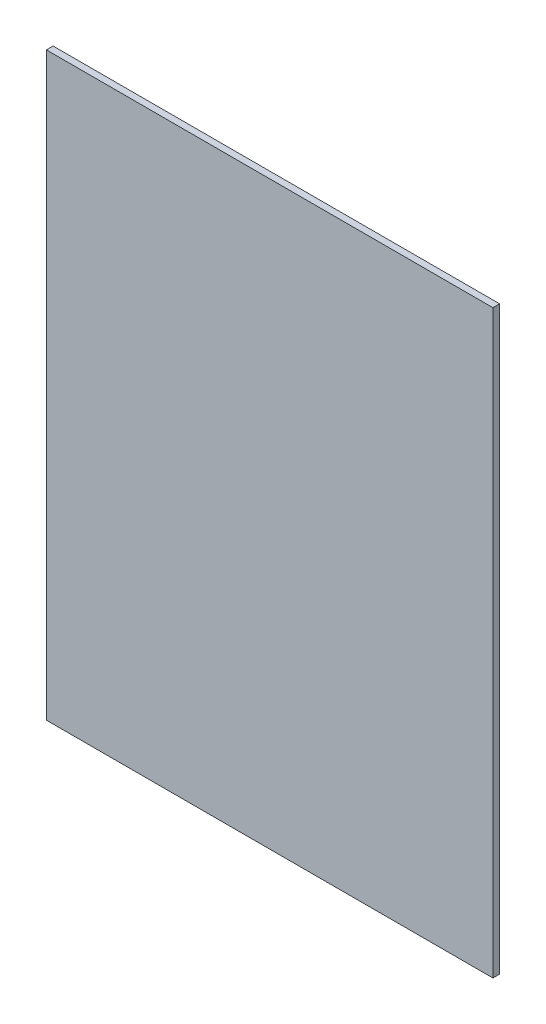
ISO-10303-21;
HEADER;
FILE_DESCRIPTION(('STEP AP214'),'2;1');
FILE_NAME('part.step','',(''),(''),'','','');
FILE_SCHEMA(('AUTOMOTIVE_DESIGN { 1 0 10303 214 1 1 1 1 }'));
ENDSEC;
DATA;
#1=APPLICATION_CONTEXT('core data for automotive mechanical design processes');
#2=APPLICATION_PROTOCOL_DEFINITION('international standard','automotive_design',2000,#1);
#3=PRODUCT_CONTEXT('',#1,'mechanical');
#4=PRODUCT('Part','Part','',(#3));
#5=PRODUCT_RELATED_PRODUCT_CATEGORY('part','',(#4));
#6=PRODUCT_DEFINITION_FORMATION('','',#4);
#7=PRODUCT_DEFINITION_CONTEXT('part definition',#1,'design');
#8=PRODUCT_DEFINITION('design','',#6,#7);
#9=PRODUCT_DEFINITION_SHAPE('','',#8);
#10=(LENGTH_UNIT() NAMED_UNIT(*) SI_UNIT(.MILLI.,.METRE.));
#11=(NAMED_UNIT(*) PLANE_ANGLE_UNIT() SI_UNIT($,.RADIAN.));
#12=(NAMED_UNIT(*) SI_UNIT($,.STERADIAN.) SOLID_ANGLE_UNIT());
#13=UNCERTAINTY_MEASURE_WITH_UNIT(LENGTH_MEASURE(1.E-05),#10,'distance_accuracy_value','');
#14=(GEOMETRIC_REPRESENTATION_CONTEXT(3) GLOBAL_UNCERTAINTY_ASSIGNED_CONTEXT((#13)) GLOBAL_UNIT_ASSIGNED_CONTEXT((#10,
#11,#12)) REPRESENTATION_CONTEXT('',''));
#15=CARTESIAN_POINT('',(0.,0.,0.));
#16=DIRECTION('',(0.,0.,1.));
#17=DIRECTION('',(1.,0.,0.));
#18=AXIS2_PLACEMENT_3D('',#15,#16,#17);
#19=CARTESIAN_POINT('',(100.,130.,3.));
#20=DIRECTION('',(-1.,0.,0.));
#21=DIRECTION('',(0.,-1.,0.));
#22=AXIS2_PLACEMENT_3D('',#19,#20,#21);
#23=PLANE('',#22);
#24=DIRECTION('',(0.,1.,0.));
#25=VECTOR('',#24,1.);
#26=CARTESIAN_POINT('',(100.,130.,0.));
#27=LINE('',#26,#25);
#28=CARTESIAN_POINT('',(100.,-130.,0.));
#29=VERTEX_POINT('',#28);
#30=CARTESIAN_POINT('',(100.,130.,0.));
#31=VERTEX_POINT('',#30);
#32=EDGE_CURVE('E97',#29,#31,#27,.T.);
#33=ORIENTED_EDGE('',*,*,#32,.T.);
#34=DIRECTION('',(0.,0.,-1.));
#35=VECTOR('',#34,1.);
#36=CARTESIAN_POINT('',(100.,130.,3.));
#37=LINE('',#36,#35);
#38=CARTESIAN_POINT('',(100.,130.,3.));
#39=VERTEX_POINT('',#38);
#40=EDGE_CURVE('E11',#39,#31,#37,.T.);
#41=ORIENTED_EDGE('',*,*,#40,.F.);
#42=DIRECTION('',(0.,1.,0.));
#43=VECTOR('',#42,1.);
#44=CARTESIAN_POINT('',(100.,130.,3.));
#45=LINE('',#44,#43);
#46=CARTESIAN_POINT('',(100.,-130.,3.));
#47=VERTEX_POINT('',#46);
#48=EDGE_CURVE('E85',#47,#39,#45,.T.);
#49=ORIENTED_EDGE('',*,*,#48,.F.);
#50=DIRECTION('',(0.,0.,-1.));
#51=VECTOR('',#50,1.);
#52=CARTESIAN_POINT('',(100.,-130.,3.));
#53=LINE('',#52,#51);
#54=EDGE_CURVE('E93',#47,#29,#53,.T.);
#55=ORIENTED_EDGE('',*,*,#54,.T.);
#56=EDGE_LOOP('',(#33,#41,#49,#55));
#57=FACE_BOUND('',#56,.T.);
#58=ADVANCED_FACE('F34',(#57),#23,.F.);
#59=CARTESIAN_POINT('',(-100.,130.,3.));
#60=DIRECTION('',(0.,-1.,0.));
#61=DIRECTION('',(0.,0.,-1.));
#62=AXIS2_PLACEMENT_3D('',#59,#60,#61);
#63=PLANE('',#62);
#64=DIRECTION('',(-1.,0.,0.));
#65=VECTOR('',#64,1.);
#66=CARTESIAN_POINT('',(-100.,130.,0.));
#67=LINE('',#66,#65);
#68=CARTESIAN_POINT('',(-100.,130.,0.));
#69=VERTEX_POINT('',#68);
#70=EDGE_CURVE('E89',#31,#69,#67,.T.);
#71=ORIENTED_EDGE('',*,*,#70,.T.);
#72=DIRECTION('',(0.,0.,-1.));
#73=VECTOR('',#72,1.);
#74=CARTESIAN_POINT('',(-100.,130.,3.));
#75=LINE('',#74,#73);
#76=CARTESIAN_POINT('',(-100.,130.,3.));
#77=VERTEX_POINT('',#76);
#78=EDGE_CURVE('E42',#77,#69,#75,.T.);
#79=ORIENTED_EDGE('',*,*,#78,.F.);
#80=DIRECTION('',(-1.,0.,0.));
#81=VECTOR('',#80,1.);
#82=CARTESIAN_POINT('',(-100.,130.,3.));
#83=LINE('',#82,#81);
#84=EDGE_CURVE('E80',#39,#77,#83,.T.);
#85=ORIENTED_EDGE('',*,*,#84,.F.);
#86=ORIENTED_EDGE('',*,*,#40,.T.);
#87=EDGE_LOOP('',(#71,#79,#85,#86));
#88=FACE_BOUND('',#87,.T.);
#89=ADVANCED_FACE('F88',(#88),#63,.F.);
#90=CARTESIAN_POINT('',(-100.,130.,3.));
#91=DIRECTION('',(1.,0.,0.));
#92=DIRECTION('',(0.,1.,0.));
#93=AXIS2_PLACEMENT_3D('',#90,#91,#92);
#94=PLANE('',#93);
#95=DIRECTION('',(0.,-1.,0.));
#96=VECTOR('',#95,1.);
#97=CARTESIAN_POINT('',(-100.,130.,0.));
#98=LINE('',#97,#96);
#99=CARTESIAN_POINT('',(-100.,-130.,0.));
#100=VERTEX_POINT('',#99);
#101=EDGE_CURVE('E67',#69,#100,#98,.T.);
#102=ORIENTED_EDGE('',*,*,#101,.T.);
#103=DIRECTION('',(0.,0.,-1.));
#104=VECTOR('',#103,1.);
#105=CARTESIAN_POINT('',(-100.,-130.,3.));
#106=LINE('',#105,#104);
#107=CARTESIAN_POINT('',(-100.,-130.,3.));
#108=VERTEX_POINT('',#107);
#109=EDGE_CURVE('E90',#108,#100,#106,.T.);
#110=ORIENTED_EDGE('',*,*,#109,.F.);
#111=DIRECTION('',(0.,-1.,0.));
#112=VECTOR('',#111,1.);
#113=CARTESIAN_POINT('',(-100.,130.,3.));
#114=LINE('',#113,#112);
#115=EDGE_CURVE('E83',#77,#108,#114,.T.);
#116=ORIENTED_EDGE('',*,*,#115,.F.);
#117=ORIENTED_EDGE('',*,*,#78,.T.);
#118=EDGE_LOOP('',(#102,#110,#116,#117));
#119=FACE_BOUND('',#118,.T.);
#120=ADVANCED_FACE('F91',(#119),#94,.F.);
#121=CARTESIAN_POINT('',(-100.,-130.,3.));
#122=DIRECTION('',(0.,1.,0.));
#123=DIRECTION('',(0.,0.,1.));
#124=AXIS2_PLACEMENT_3D('',#121,#122,#123);
#125=PLANE('',#124);
#126=DIRECTION('',(1.,0.,0.));
#127=VECTOR('',#126,1.);
#128=CARTESIAN_POINT('',(-100.,-130.,0.));
#129=LINE('',#128,#127);
#130=EDGE_CURVE('E73',#100,#29,#129,.T.);
#131=ORIENTED_EDGE('',*,*,#130,.T.);
#132=ORIENTED_EDGE('',*,*,#54,.F.);
#133=DIRECTION('',(1.,0.,0.));
#134=VECTOR('',#133,1.);
#135=CARTESIAN_POINT('',(-100.,-130.,3.));
#136=LINE('',#135,#134);
#137=EDGE_CURVE('E50',#108,#47,#136,.T.);
#138=ORIENTED_EDGE('',*,*,#137,.F.);
#139=ORIENTED_EDGE('',*,*,#109,.T.);
#140=EDGE_LOOP('',(#131,#132,#138,#139));
#141=FACE_BOUND('',#140,.T.);
#142=ADVANCED_FACE('F104',(#141),#125,.F.);
#143=CARTESIAN_POINT('',(0.,0.,3.));
#144=DIRECTION('',(0.,0.,1.));
#145=DIRECTION('',(1.,0.,0.));
#146=AXIS2_PLACEMENT_3D('',#143,#144,#145);
#147=PLANE('',#146);
#148=ORIENTED_EDGE('',*,*,#48,.T.);
#149=ORIENTED_EDGE('',*,*,#84,.T.);
#150=ORIENTED_EDGE('',*,*,#115,.T.);
#151=ORIENTED_EDGE('',*,*,#137,.T.);
#152=EDGE_LOOP('',(#148,#149,#150,#151));
#153=FACE_BOUND('',#152,.T.);
#154=ADVANCED_FACE('F81',(#153),#147,.T.);
#155=CARTESIAN_POINT('',(0.,0.,0.));
#156=DIRECTION('',(0.,0.,1.));
#157=DIRECTION('',(1.,0.,0.));
#158=AXIS2_PLACEMENT_3D('',#155,#156,#157);
#159=PLANE('',#158);
#160=ORIENTED_EDGE('',*,*,#32,.F.);
#161=ORIENTED_EDGE('',*,*,#130,.F.);
#162=ORIENTED_EDGE('',*,*,#101,.F.);
#163=ORIENTED_EDGE('',*,*,#70,.F.);
#164=EDGE_LOOP('',(#160,#161,#162,#163));
#165=FACE_BOUND('',#164,.T.);
#166=ADVANCED_FACE('F107',(#165),#159,.F.);
#167=CLOSED_SHELL('',(#58,#89,#120,#142,#154,#166));
#168=MANIFOLD_SOLID_BREP('B2',#167);
#169=ADVANCED_BREP_SHAPE_REPRESENTATION('',(#18,#168),#14);
#170=SHAPE_DEFINITION_REPRESENTATION(#9,#169);
ENDSEC;
END-ISO-10303-21;
